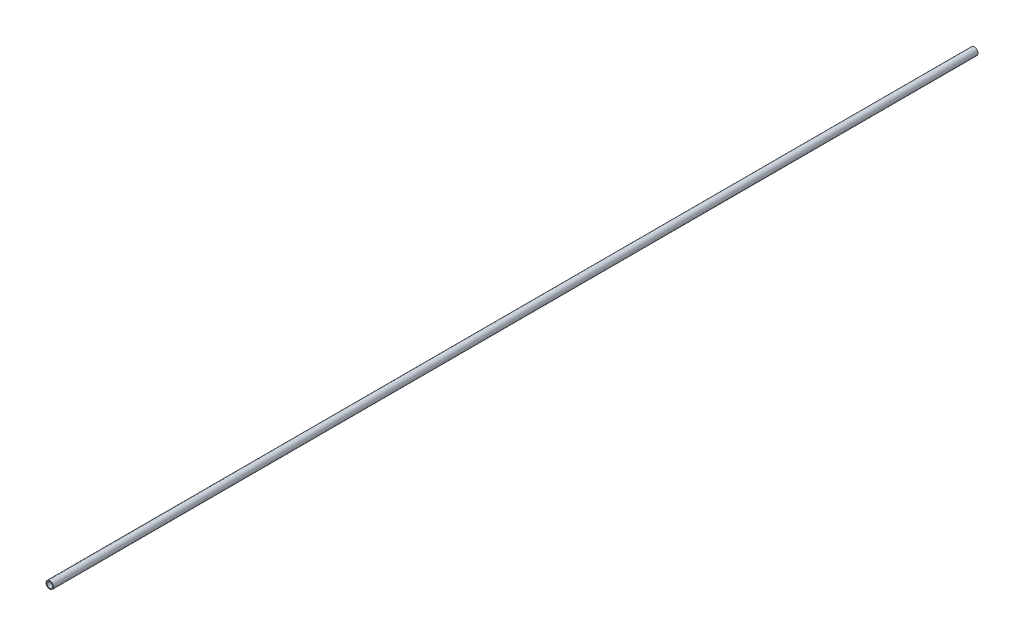
ISO-10303-21;
HEADER;
FILE_DESCRIPTION(('STEP AP214'),'2;1');
FILE_NAME('part.step','',(''),(''),'','','');
FILE_SCHEMA(('AUTOMOTIVE_DESIGN { 1 0 10303 214 1 1 1 1 }'));
ENDSEC;
DATA;
#1=APPLICATION_CONTEXT('core data for automotive mechanical design processes');
#2=APPLICATION_PROTOCOL_DEFINITION('international standard','automotive_design',2000,#1);
#3=PRODUCT_CONTEXT('',#1,'mechanical');
#4=PRODUCT('Part','Part','',(#3));
#5=PRODUCT_RELATED_PRODUCT_CATEGORY('part','',(#4));
#6=PRODUCT_DEFINITION_FORMATION('','',#4);
#7=PRODUCT_DEFINITION_CONTEXT('part definition',#1,'design');
#8=PRODUCT_DEFINITION('design','',#6,#7);
#9=PRODUCT_DEFINITION_SHAPE('','',#8);
#10=(LENGTH_UNIT() NAMED_UNIT(*) SI_UNIT(.MILLI.,.METRE.));
#11=(NAMED_UNIT(*) PLANE_ANGLE_UNIT() SI_UNIT($,.RADIAN.));
#12=(NAMED_UNIT(*) SI_UNIT($,.STERADIAN.) SOLID_ANGLE_UNIT());
#13=UNCERTAINTY_MEASURE_WITH_UNIT(LENGTH_MEASURE(1.E-05),#10,'distance_accuracy_value','');
#14=(GEOMETRIC_REPRESENTATION_CONTEXT(3) GLOBAL_UNCERTAINTY_ASSIGNED_CONTEXT((#13)) GLOBAL_UNIT_ASSIGNED_CONTEXT((#10,
#11,#12)) REPRESENTATION_CONTEXT('',''));
#15=CARTESIAN_POINT('',(0.,0.,0.));
#16=DIRECTION('',(0.,0.,1.));
#17=DIRECTION('',(1.,0.,0.));
#18=AXIS2_PLACEMENT_3D('',#15,#16,#17);
#19=CARTESIAN_POINT('',(0.,0.,1000.));
#20=DIRECTION('',(0.,0.,1.));
#21=DIRECTION('',(1.,0.,0.));
#22=AXIS2_PLACEMENT_3D('',#19,#20,#21);
#23=PLANE('',#22);
#24=CARTESIAN_POINT('',(0.,0.,1000.));
#25=DIRECTION('',(0.,0.,1.));
#26=DIRECTION('',(1.,0.,0.));
#27=AXIS2_PLACEMENT_3D('',#24,#25,#26);
#28=CIRCLE('',#27,4.);
#29=CARTESIAN_POINT('',(4.,0.,1000.));
#30=VERTEX_POINT('',#29);
#31=EDGE_CURVE('E10',#30,#30,#28,.T.);
#32=ORIENTED_EDGE('',*,*,#31,.T.);
#33=EDGE_LOOP('',(#32));
#34=FACE_BOUND('',#33,.T.);
#35=CARTESIAN_POINT('',(0.,0.,1000.));
#36=DIRECTION('',(0.,0.,1.));
#37=DIRECTION('',(1.,0.,0.));
#38=AXIS2_PLACEMENT_3D('',#35,#36,#37);
#39=CIRCLE('',#38,3.);
#40=CARTESIAN_POINT('',(3.,0.,1000.));
#41=VERTEX_POINT('',#40);
#42=EDGE_CURVE('E42',#41,#41,#39,.T.);
#43=ORIENTED_EDGE('',*,*,#42,.F.);
#44=EDGE_LOOP('',(#43));
#45=FACE_BOUND('',#44,.T.);
#46=ADVANCED_FACE('F31',(#34,#45),#23,.T.);
#47=CARTESIAN_POINT('',(0.,0.,0.));
#48=DIRECTION('',(0.,0.,1.));
#49=DIRECTION('',(1.,0.,0.));
#50=AXIS2_PLACEMENT_3D('',#47,#48,#49);
#51=PLANE('',#50);
#52=CARTESIAN_POINT('',(0.,0.,0.));
#53=DIRECTION('',(0.,0.,1.));
#54=DIRECTION('',(1.,0.,0.));
#55=AXIS2_PLACEMENT_3D('',#52,#53,#54);
#56=CIRCLE('',#55,4.);
#57=CARTESIAN_POINT('',(4.,0.,0.));
#58=VERTEX_POINT('',#57);
#59=EDGE_CURVE('E35',#58,#58,#56,.T.);
#60=ORIENTED_EDGE('',*,*,#59,.F.);
#61=EDGE_LOOP('',(#60));
#62=FACE_BOUND('',#61,.T.);
#63=CARTESIAN_POINT('',(0.,0.,0.));
#64=DIRECTION('',(0.,0.,1.));
#65=DIRECTION('',(1.,0.,0.));
#66=AXIS2_PLACEMENT_3D('',#63,#64,#65);
#67=CIRCLE('',#66,3.);
#68=CARTESIAN_POINT('',(3.,0.,0.));
#69=VERTEX_POINT('',#68);
#70=EDGE_CURVE('E44',#69,#69,#67,.T.);
#71=ORIENTED_EDGE('',*,*,#70,.T.);
#72=EDGE_LOOP('',(#71));
#73=FACE_BOUND('',#72,.T.);
#74=ADVANCED_FACE('F54',(#62,#73),#51,.F.);
#75=CARTESIAN_POINT('',(0.,0.,1000.));
#76=DIRECTION('',(0.,0.,-1.));
#77=DIRECTION('',(-1.,0.,0.));
#78=AXIS2_PLACEMENT_3D('',#75,#76,#77);
#79=CYLINDRICAL_SURFACE('',#78,4.);
#80=ORIENTED_EDGE('',*,*,#31,.F.);
#81=EDGE_LOOP('',(#80));
#82=FACE_BOUND('',#81,.T.);
#83=ORIENTED_EDGE('',*,*,#59,.T.);
#84=EDGE_LOOP('',(#83));
#85=FACE_BOUND('',#84,.T.);
#86=ADVANCED_FACE('F33',(#82,#85),#79,.T.);
#87=CARTESIAN_POINT('',(0.,0.,1000.));
#88=DIRECTION('',(0.,0.,-1.));
#89=DIRECTION('',(-1.,0.,0.));
#90=AXIS2_PLACEMENT_3D('',#87,#88,#89);
#91=CYLINDRICAL_SURFACE('',#90,3.);
#92=ORIENTED_EDGE('',*,*,#42,.T.);
#93=EDGE_LOOP('',(#92));
#94=FACE_BOUND('',#93,.T.);
#95=ORIENTED_EDGE('',*,*,#70,.F.);
#96=EDGE_LOOP('',(#95));
#97=FACE_BOUND('',#96,.T.);
#98=ADVANCED_FACE('F50',(#94,#97),#91,.F.);
#99=CLOSED_SHELL('',(#46,#74,#86,#98));
#100=MANIFOLD_SOLID_BREP('B2',#99);
#101=ADVANCED_BREP_SHAPE_REPRESENTATION('',(#18,#100),#14);
#102=SHAPE_DEFINITION_REPRESENTATION(#9,#101);
ENDSEC;
END-ISO-10303-21;
